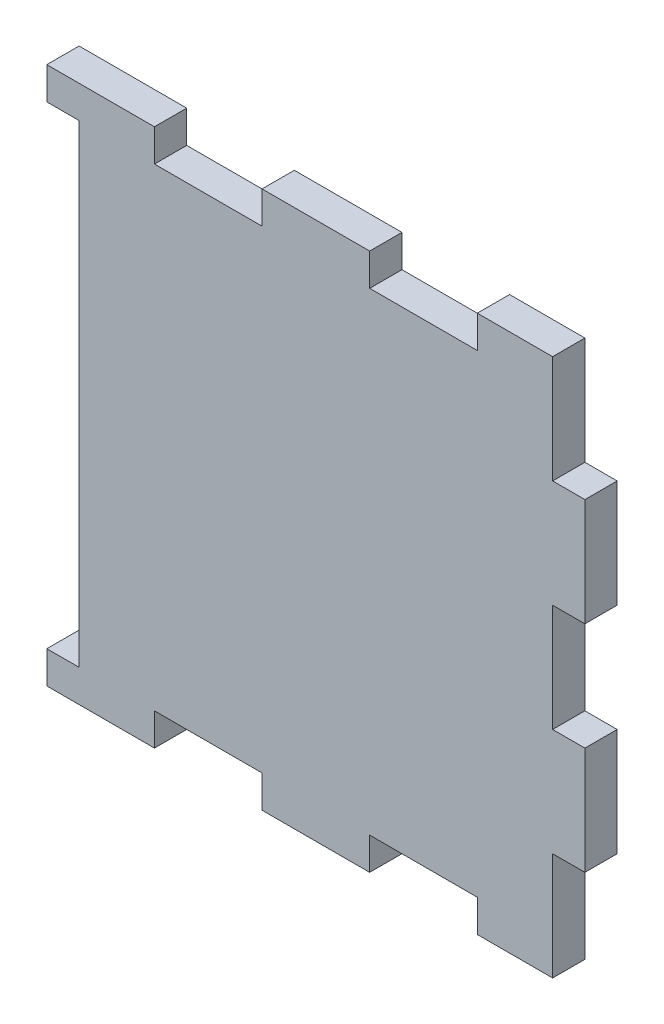
ISO-10303-21;
HEADER;
FILE_DESCRIPTION(('STEP AP214'),'2;1');
FILE_NAME('part.step','',(''),(''),'','','');
FILE_SCHEMA(('AUTOMOTIVE_DESIGN { 1 0 10303 214 1 1 1 1 }'));
ENDSEC;
DATA;
#1=APPLICATION_CONTEXT('core data for automotive mechanical design processes');
#2=APPLICATION_PROTOCOL_DEFINITION('international standard','automotive_design',2000,#1);
#3=PRODUCT_CONTEXT('',#1,'mechanical');
#4=PRODUCT('Part','Part','',(#3));
#5=PRODUCT_RELATED_PRODUCT_CATEGORY('part','',(#4));
#6=PRODUCT_DEFINITION_FORMATION('','',#4);
#7=PRODUCT_DEFINITION_CONTEXT('part definition',#1,'design');
#8=PRODUCT_DEFINITION('design','',#6,#7);
#9=PRODUCT_DEFINITION_SHAPE('','',#8);
#10=(LENGTH_UNIT() NAMED_UNIT(*) SI_UNIT(.MILLI.,.METRE.));
#11=(NAMED_UNIT(*) PLANE_ANGLE_UNIT() SI_UNIT($,.RADIAN.));
#12=(NAMED_UNIT(*) SI_UNIT($,.STERADIAN.) SOLID_ANGLE_UNIT());
#13=UNCERTAINTY_MEASURE_WITH_UNIT(LENGTH_MEASURE(1.E-05),#10,'distance_accuracy_value','');
#14=(GEOMETRIC_REPRESENTATION_CONTEXT(3) GLOBAL_UNCERTAINTY_ASSIGNED_CONTEXT((#13)) GLOBAL_UNIT_ASSIGNED_CONTEXT((#10,
#11,#12)) REPRESENTATION_CONTEXT('',''));
#15=CARTESIAN_POINT('',(0.,0.,0.));
#16=DIRECTION('',(0.,0.,1.));
#17=DIRECTION('',(1.,0.,0.));
#18=AXIS2_PLACEMENT_3D('',#15,#16,#17);
#19=CARTESIAN_POINT('',(-25.,-25.,3.));
#20=DIRECTION('',(1.,0.,0.));
#21=DIRECTION('',(0.,0.,-1.));
#22=AXIS2_PLACEMENT_3D('',#19,#20,#21);
#23=PLANE('',#22);
#24=DIRECTION('',(0.,-1.,0.));
#25=VECTOR('',#24,1.);
#26=CARTESIAN_POINT('',(-25.,-25.,3.));
#27=LINE('',#26,#25);
#28=CARTESIAN_POINT('',(-25.,-21.9999999999989,3.));
#29=VERTEX_POINT('',#28);
#30=CARTESIAN_POINT('',(-25.,-25.,3.));
#31=VERTEX_POINT('',#30);
#32=EDGE_CURVE('E457',#29,#31,#27,.T.);
#33=ORIENTED_EDGE('',*,*,#32,.F.);
#34=DIRECTION('',(0.,0.,-1.));
#35=VECTOR('',#34,1.);
#36=CARTESIAN_POINT('',(-25.,-21.9999999999989,14.9999999999996));
#37=LINE('',#36,#35);
#38=CARTESIAN_POINT('',(-25.,-21.9999999999989,-3.87710696880816E-13));
#39=VERTEX_POINT('',#38);
#40=EDGE_CURVE('E266',#29,#39,#37,.T.);
#41=ORIENTED_EDGE('',*,*,#40,.T.);
#42=DIRECTION('',(0.,-1.,0.));
#43=VECTOR('',#42,1.);
#44=CARTESIAN_POINT('',(-25.,-25.,0.));
#45=LINE('',#44,#43);
#46=CARTESIAN_POINT('',(-25.,-25.,0.));
#47=VERTEX_POINT('',#46);
#48=EDGE_CURVE('E271',#39,#47,#45,.T.);
#49=ORIENTED_EDGE('',*,*,#48,.T.);
#50=DIRECTION('',(0.,0.,-1.));
#51=VECTOR('',#50,1.);
#52=CARTESIAN_POINT('',(-25.,-25.,3.));
#53=LINE('',#52,#51);
#54=EDGE_CURVE('E461',#31,#47,#53,.T.);
#55=ORIENTED_EDGE('',*,*,#54,.F.);
#56=EDGE_LOOP('',(#33,#41,#49,#55));
#57=FACE_BOUND('',#56,.T.);
#58=ADVANCED_FACE('F43',(#57),#23,.F.);
#59=CARTESIAN_POINT('',(0.,0.,3.));
#60=DIRECTION('',(0.,0.,-1.));
#61=DIRECTION('',(-1.,0.,0.));
#62=AXIS2_PLACEMENT_3D('',#59,#60,#61);
#63=PLANE('',#62);
#64=DIRECTION('',(-1.,0.,0.));
#65=VECTOR('',#64,1.);
#66=CARTESIAN_POINT('',(0.,22.0000000000011,3.));
#67=LINE('',#66,#65);
#68=CARTESIAN_POINT('',(-22.,22.0000000000011,3.));
#69=VERTEX_POINT('',#68);
#70=CARTESIAN_POINT('',(-25.,22.0000000000011,3.));
#71=VERTEX_POINT('',#70);
#72=EDGE_CURVE('E11',#69,#71,#67,.T.);
#73=ORIENTED_EDGE('',*,*,#72,.F.);
#74=DIRECTION('',(0.,1.,0.));
#75=VECTOR('',#74,1.);
#76=CARTESIAN_POINT('',(-22.,0.,3.));
#77=LINE('',#76,#75);
#78=CARTESIAN_POINT('',(-22.,-21.9999999999989,3.));
#79=VERTEX_POINT('',#78);
#80=EDGE_CURVE('E273',#79,#69,#77,.T.);
#81=ORIENTED_EDGE('',*,*,#80,.F.);
#82=DIRECTION('',(1.,0.,0.));
#83=VECTOR('',#82,1.);
#84=CARTESIAN_POINT('',(0.,-21.9999999999989,3.));
#85=LINE('',#84,#83);
#86=EDGE_CURVE('E51',#29,#79,#85,.T.);
#87=ORIENTED_EDGE('',*,*,#86,.F.);
#88=ORIENTED_EDGE('',*,*,#32,.T.);
#89=DIRECTION('',(1.,0.,0.));
#90=VECTOR('',#89,1.);
#91=CARTESIAN_POINT('',(-25.,-25.,3.));
#92=LINE('',#91,#90);
#93=CARTESIAN_POINT('',(-15.,-25.,3.));
#94=VERTEX_POINT('',#93);
#95=EDGE_CURVE('E458',#31,#94,#92,.T.);
#96=ORIENTED_EDGE('',*,*,#95,.T.);
#97=DIRECTION('',(0.,-1.,0.));
#98=VECTOR('',#97,1.);
#99=CARTESIAN_POINT('',(-15.,-25.,3.));
#100=LINE('',#99,#98);
#101=CARTESIAN_POINT('',(-15.,-22.,3.));
#102=VERTEX_POINT('',#101);
#103=EDGE_CURVE('E335',#102,#94,#100,.T.);
#104=ORIENTED_EDGE('',*,*,#103,.F.);
#105=DIRECTION('',(-1.,0.,0.));
#106=VECTOR('',#105,1.);
#107=CARTESIAN_POINT('',(-15.,-22.,3.));
#108=LINE('',#107,#106);
#109=CARTESIAN_POINT('',(-5.,-22.,3.));
#110=VERTEX_POINT('',#109);
#111=EDGE_CURVE('E337',#110,#102,#108,.T.);
#112=ORIENTED_EDGE('',*,*,#111,.F.);
#113=DIRECTION('',(0.,1.,0.));
#114=VECTOR('',#113,1.);
#115=CARTESIAN_POINT('',(-5.00000000000001,-25.,3.));
#116=LINE('',#115,#114);
#117=CARTESIAN_POINT('',(-5.00000000000001,-25.,3.));
#118=VERTEX_POINT('',#117);
#119=EDGE_CURVE('E341',#118,#110,#116,.T.);
#120=ORIENTED_EDGE('',*,*,#119,.F.);
#121=CARTESIAN_POINT('',(5.,-25.,3.));
#122=VERTEX_POINT('',#121);
#123=EDGE_CURVE('E462',#118,#122,#92,.T.);
#124=ORIENTED_EDGE('',*,*,#123,.T.);
#125=DIRECTION('',(0.,-1.,0.));
#126=VECTOR('',#125,1.);
#127=CARTESIAN_POINT('',(5.,-25.,3.));
#128=LINE('',#127,#126);
#129=CARTESIAN_POINT('',(5.,-22.,3.));
#130=VERTEX_POINT('',#129);
#131=EDGE_CURVE('E403',#130,#122,#128,.T.);
#132=ORIENTED_EDGE('',*,*,#131,.F.);
#133=DIRECTION('',(-1.,0.,0.));
#134=VECTOR('',#133,1.);
#135=CARTESIAN_POINT('',(5.,-22.,3.));
#136=LINE('',#135,#134);
#137=CARTESIAN_POINT('',(15.,-22.,3.));
#138=VERTEX_POINT('',#137);
#139=EDGE_CURVE('E405',#138,#130,#136,.T.);
#140=ORIENTED_EDGE('',*,*,#139,.F.);
#141=DIRECTION('',(0.,1.,0.));
#142=VECTOR('',#141,1.);
#143=CARTESIAN_POINT('',(15.,-25.,3.));
#144=LINE('',#143,#142);
#145=CARTESIAN_POINT('',(15.,-25.,3.));
#146=VERTEX_POINT('',#145);
#147=EDGE_CURVE('E376',#146,#138,#144,.T.);
#148=ORIENTED_EDGE('',*,*,#147,.F.);
#149=CARTESIAN_POINT('',(22.,-25.,3.));
#150=VERTEX_POINT('',#149);
#151=EDGE_CURVE('E456',#146,#150,#92,.T.);
#152=ORIENTED_EDGE('',*,*,#151,.T.);
#153=DIRECTION('',(0.,-1.,0.));
#154=VECTOR('',#153,1.);
#155=CARTESIAN_POINT('',(22.,-25.,3.));
#156=LINE('',#155,#154);
#157=CARTESIAN_POINT('',(22.,-15.,3.));
#158=VERTEX_POINT('',#157);
#159=EDGE_CURVE('E289',#158,#150,#156,.T.);
#160=ORIENTED_EDGE('',*,*,#159,.F.);
#161=DIRECTION('',(-1.,0.,0.));
#162=VECTOR('',#161,1.);
#163=CARTESIAN_POINT('',(25.,-15.,3.));
#164=LINE('',#163,#162);
#165=CARTESIAN_POINT('',(25.,-15.,3.));
#166=VERTEX_POINT('',#165);
#167=EDGE_CURVE('E291',#166,#158,#164,.T.);
#168=ORIENTED_EDGE('',*,*,#167,.F.);
#169=DIRECTION('',(0.,1.,0.));
#170=VECTOR('',#169,1.);
#171=CARTESIAN_POINT('',(25.,-25.,3.));
#172=LINE('',#171,#170);
#173=CARTESIAN_POINT('',(25.,-5.,3.));
#174=VERTEX_POINT('',#173);
#175=EDGE_CURVE('E447',#166,#174,#172,.T.);
#176=ORIENTED_EDGE('',*,*,#175,.T.);
#177=DIRECTION('',(1.,0.,0.));
#178=VECTOR('',#177,1.);
#179=CARTESIAN_POINT('',(25.,-5.,3.));
#180=LINE('',#179,#178);
#181=CARTESIAN_POINT('',(22.,-5.,3.));
#182=VERTEX_POINT('',#181);
#183=EDGE_CURVE('E309',#182,#174,#180,.T.);
#184=ORIENTED_EDGE('',*,*,#183,.F.);
#185=DIRECTION('',(0.,-1.,0.));
#186=VECTOR('',#185,1.);
#187=CARTESIAN_POINT('',(22.,5.,3.));
#188=LINE('',#187,#186);
#189=CARTESIAN_POINT('',(22.,5.,3.));
#190=VERTEX_POINT('',#189);
#191=EDGE_CURVE('E311',#190,#182,#188,.T.);
#192=ORIENTED_EDGE('',*,*,#191,.F.);
#193=DIRECTION('',(-1.,0.,0.));
#194=VECTOR('',#193,1.);
#195=CARTESIAN_POINT('',(25.,5.,3.));
#196=LINE('',#195,#194);
#197=CARTESIAN_POINT('',(25.,5.,3.));
#198=VERTEX_POINT('',#197);
#199=EDGE_CURVE('E288',#198,#190,#196,.T.);
#200=ORIENTED_EDGE('',*,*,#199,.F.);
#201=CARTESIAN_POINT('',(25.,15.,3.));
#202=VERTEX_POINT('',#201);
#203=EDGE_CURVE('E444',#198,#202,#172,.T.);
#204=ORIENTED_EDGE('',*,*,#203,.T.);
#205=DIRECTION('',(1.,0.,0.));
#206=VECTOR('',#205,1.);
#207=CARTESIAN_POINT('',(25.,15.,3.));
#208=LINE('',#207,#206);
#209=CARTESIAN_POINT('',(22.,15.,3.));
#210=VERTEX_POINT('',#209);
#211=EDGE_CURVE('E358',#210,#202,#208,.T.);
#212=ORIENTED_EDGE('',*,*,#211,.F.);
#213=DIRECTION('',(0.,-1.,0.));
#214=VECTOR('',#213,1.);
#215=CARTESIAN_POINT('',(22.,25.,3.));
#216=LINE('',#215,#214);
#217=CARTESIAN_POINT('',(22.,25.,3.));
#218=VERTEX_POINT('',#217);
#219=EDGE_CURVE('E334',#218,#210,#216,.T.);
#220=ORIENTED_EDGE('',*,*,#219,.F.);
#221=DIRECTION('',(-1.,0.,0.));
#222=VECTOR('',#221,1.);
#223=CARTESIAN_POINT('',(-25.,25.,3.));
#224=LINE('',#223,#222);
#225=CARTESIAN_POINT('',(15.,25.,3.));
#226=VERTEX_POINT('',#225);
#227=EDGE_CURVE('E452',#218,#226,#224,.T.);
#228=ORIENTED_EDGE('',*,*,#227,.T.);
#229=DIRECTION('',(0.,1.,0.));
#230=VECTOR('',#229,1.);
#231=CARTESIAN_POINT('',(15.,25.,3.));
#232=LINE('',#231,#230);
#233=CARTESIAN_POINT('',(15.,22.,3.));
#234=VERTEX_POINT('',#233);
#235=EDGE_CURVE('E377',#234,#226,#232,.T.);
#236=ORIENTED_EDGE('',*,*,#235,.F.);
#237=DIRECTION('',(1.,0.,0.));
#238=VECTOR('',#237,1.);
#239=CARTESIAN_POINT('',(5.,22.,3.));
#240=LINE('',#239,#238);
#241=CARTESIAN_POINT('',(5.,22.,3.));
#242=VERTEX_POINT('',#241);
#243=EDGE_CURVE('E379',#242,#234,#240,.T.);
#244=ORIENTED_EDGE('',*,*,#243,.F.);
#245=DIRECTION('',(0.,-1.,0.));
#246=VECTOR('',#245,1.);
#247=CARTESIAN_POINT('',(5.,25.,3.));
#248=LINE('',#247,#246);
#249=CARTESIAN_POINT('',(5.,25.,3.));
#250=VERTEX_POINT('',#249);
#251=EDGE_CURVE('E383',#250,#242,#248,.T.);
#252=ORIENTED_EDGE('',*,*,#251,.F.);
#253=CARTESIAN_POINT('',(-5.00000000000001,25.,3.));
#254=VERTEX_POINT('',#253);
#255=EDGE_CURVE('E451',#250,#254,#224,.T.);
#256=ORIENTED_EDGE('',*,*,#255,.T.);
#257=DIRECTION('',(0.,1.,0.));
#258=VECTOR('',#257,1.);
#259=CARTESIAN_POINT('',(-5.00000000000001,25.,3.));
#260=LINE('',#259,#258);
#261=CARTESIAN_POINT('',(-5.,22.,3.));
#262=VERTEX_POINT('',#261);
#263=EDGE_CURVE('E422',#262,#254,#260,.T.);
#264=ORIENTED_EDGE('',*,*,#263,.F.);
#265=DIRECTION('',(1.,0.,0.));
#266=VECTOR('',#265,1.);
#267=CARTESIAN_POINT('',(-15.,22.,3.));
#268=LINE('',#267,#266);
#269=CARTESIAN_POINT('',(-15.,22.,3.));
#270=VERTEX_POINT('',#269);
#271=EDGE_CURVE('E431',#270,#262,#268,.T.);
#272=ORIENTED_EDGE('',*,*,#271,.F.);
#273=DIRECTION('',(0.,-1.,0.));
#274=VECTOR('',#273,1.);
#275=CARTESIAN_POINT('',(-15.,25.,3.));
#276=LINE('',#275,#274);
#277=CARTESIAN_POINT('',(-15.,25.,3.));
#278=VERTEX_POINT('',#277);
#279=EDGE_CURVE('E386',#278,#270,#276,.T.);
#280=ORIENTED_EDGE('',*,*,#279,.F.);
#281=CARTESIAN_POINT('',(-25.,25.,3.));
#282=VERTEX_POINT('',#281);
#283=EDGE_CURVE('E449',#278,#282,#224,.T.);
#284=ORIENTED_EDGE('',*,*,#283,.T.);
#285=EDGE_CURVE('E453',#282,#71,#27,.T.);
#286=ORIENTED_EDGE('',*,*,#285,.T.);
#287=EDGE_LOOP('',(#73,#81,#87,#88,#96,#104,#112,#120,#124,#132,#140,#148,#152,#160,#168,#176,
#184,#192,#200,#204,#212,#220,#228,#236,#244,#252,#256,#264,#272,#280,#284,#286));
#288=FACE_BOUND('',#287,.T.);
#289=ADVANCED_FACE('F498',(#288),#63,.F.);
#290=CARTESIAN_POINT('',(0.,0.,0.));
#291=DIRECTION('',(0.,0.,-1.));
#292=DIRECTION('',(-1.,0.,0.));
#293=AXIS2_PLACEMENT_3D('',#290,#291,#292);
#294=PLANE('',#293);
#295=DIRECTION('',(0.,1.,0.));
#296=VECTOR('',#295,1.);
#297=CARTESIAN_POINT('',(-22.,-21.9999999999989,-3.87710696880816E-13));
#298=LINE('',#297,#296);
#299=CARTESIAN_POINT('',(-22.,-21.9999999999989,-3.87710696880816E-13));
#300=VERTEX_POINT('',#299);
#301=CARTESIAN_POINT('',(-22.,22.0000000000011,0.));
#302=VERTEX_POINT('',#301);
#303=EDGE_CURVE('E263',#300,#302,#298,.T.);
#304=ORIENTED_EDGE('',*,*,#303,.T.);
#305=DIRECTION('',(-1.,0.,0.));
#306=VECTOR('',#305,1.);
#307=CARTESIAN_POINT('',(-22.,22.0000000000011,-3.87710696880816E-13));
#308=LINE('',#307,#306);
#309=CARTESIAN_POINT('',(-25.,22.0000000000011,-3.87710696880816E-13));
#310=VERTEX_POINT('',#309);
#311=EDGE_CURVE('E58',#302,#310,#308,.T.);
#312=ORIENTED_EDGE('',*,*,#311,.T.);
#313=CARTESIAN_POINT('',(-25.,25.,0.));
#314=VERTEX_POINT('',#313);
#315=EDGE_CURVE('E470',#314,#310,#45,.T.);
#316=ORIENTED_EDGE('',*,*,#315,.F.);
#317=DIRECTION('',(-1.,0.,0.));
#318=VECTOR('',#317,1.);
#319=CARTESIAN_POINT('',(-25.,25.,0.));
#320=LINE('',#319,#318);
#321=CARTESIAN_POINT('',(-15.,25.,0.));
#322=VERTEX_POINT('',#321);
#323=EDGE_CURVE('E466',#322,#314,#320,.T.);
#324=ORIENTED_EDGE('',*,*,#323,.F.);
#325=DIRECTION('',(0.,-1.,0.));
#326=VECTOR('',#325,1.);
#327=CARTESIAN_POINT('',(-15.,25.,0.));
#328=LINE('',#327,#326);
#329=CARTESIAN_POINT('',(-15.,22.,0.));
#330=VERTEX_POINT('',#329);
#331=EDGE_CURVE('E418',#322,#330,#328,.T.);
#332=ORIENTED_EDGE('',*,*,#331,.T.);
#333=DIRECTION('',(1.,0.,0.));
#334=VECTOR('',#333,1.);
#335=CARTESIAN_POINT('',(-15.,22.,0.));
#336=LINE('',#335,#334);
#337=CARTESIAN_POINT('',(-5.,22.,0.));
#338=VERTEX_POINT('',#337);
#339=EDGE_CURVE('E421',#330,#338,#336,.T.);
#340=ORIENTED_EDGE('',*,*,#339,.T.);
#341=DIRECTION('',(0.,1.,0.));
#342=VECTOR('',#341,1.);
#343=CARTESIAN_POINT('',(-5.00000000000001,25.,0.));
#344=LINE('',#343,#342);
#345=CARTESIAN_POINT('',(-5.00000000000001,25.,0.));
#346=VERTEX_POINT('',#345);
#347=EDGE_CURVE('E425',#338,#346,#344,.T.);
#348=ORIENTED_EDGE('',*,*,#347,.T.);
#349=CARTESIAN_POINT('',(5.,25.,0.));
#350=VERTEX_POINT('',#349);
#351=EDGE_CURVE('E468',#350,#346,#320,.T.);
#352=ORIENTED_EDGE('',*,*,#351,.F.);
#353=DIRECTION('',(0.,-1.,0.));
#354=VECTOR('',#353,1.);
#355=CARTESIAN_POINT('',(5.,25.,0.));
#356=LINE('',#355,#354);
#357=CARTESIAN_POINT('',(5.,22.,0.));
#358=VERTEX_POINT('',#357);
#359=EDGE_CURVE('E380',#350,#358,#356,.T.);
#360=ORIENTED_EDGE('',*,*,#359,.T.);
#361=DIRECTION('',(1.,0.,0.));
#362=VECTOR('',#361,1.);
#363=CARTESIAN_POINT('',(5.,22.,0.));
#364=LINE('',#363,#362);
#365=CARTESIAN_POINT('',(15.,22.,0.));
#366=VERTEX_POINT('',#365);
#367=EDGE_CURVE('E389',#358,#366,#364,.T.);
#368=ORIENTED_EDGE('',*,*,#367,.T.);
#369=DIRECTION('',(0.,1.,0.));
#370=VECTOR('',#369,1.);
#371=CARTESIAN_POINT('',(15.,25.,0.));
#372=LINE('',#371,#370);
#373=CARTESIAN_POINT('',(15.,25.,0.));
#374=VERTEX_POINT('',#373);
#375=EDGE_CURVE('E368',#366,#374,#372,.T.);
#376=ORIENTED_EDGE('',*,*,#375,.T.);
#377=CARTESIAN_POINT('',(22.,25.,0.));
#378=VERTEX_POINT('',#377);
#379=EDGE_CURVE('E469',#378,#374,#320,.T.);
#380=ORIENTED_EDGE('',*,*,#379,.F.);
#381=DIRECTION('',(0.,-1.,0.));
#382=VECTOR('',#381,1.);
#383=CARTESIAN_POINT('',(22.,25.,0.));
#384=LINE('',#383,#382);
#385=CARTESIAN_POINT('',(22.,15.,0.));
#386=VERTEX_POINT('',#385);
#387=EDGE_CURVE('E360',#378,#386,#384,.T.);
#388=ORIENTED_EDGE('',*,*,#387,.T.);
#389=DIRECTION('',(1.,0.,0.));
#390=VECTOR('',#389,1.);
#391=CARTESIAN_POINT('',(25.,15.,0.));
#392=LINE('',#391,#390);
#393=CARTESIAN_POINT('',(25.,15.,0.));
#394=VERTEX_POINT('',#393);
#395=EDGE_CURVE('E66',#386,#394,#392,.T.);
#396=ORIENTED_EDGE('',*,*,#395,.T.);
#397=DIRECTION('',(0.,1.,0.));
#398=VECTOR('',#397,1.);
#399=CARTESIAN_POINT('',(25.,-25.,0.));
#400=LINE('',#399,#398);
#401=CARTESIAN_POINT('',(25.,5.,0.));
#402=VERTEX_POINT('',#401);
#403=EDGE_CURVE('E437',#402,#394,#400,.T.);
#404=ORIENTED_EDGE('',*,*,#403,.F.);
#405=DIRECTION('',(-1.,0.,0.));
#406=VECTOR('',#405,1.);
#407=CARTESIAN_POINT('',(25.,5.,0.));
#408=LINE('',#407,#406);
#409=CARTESIAN_POINT('',(22.,5.,0.));
#410=VERTEX_POINT('',#409);
#411=EDGE_CURVE('E312',#402,#410,#408,.T.);
#412=ORIENTED_EDGE('',*,*,#411,.T.);
#413=DIRECTION('',(0.,-1.,0.));
#414=VECTOR('',#413,1.);
#415=CARTESIAN_POINT('',(22.,5.,0.));
#416=LINE('',#415,#414);
#417=CARTESIAN_POINT('',(22.,-5.,0.));
#418=VERTEX_POINT('',#417);
#419=EDGE_CURVE('E319',#410,#418,#416,.T.);
#420=ORIENTED_EDGE('',*,*,#419,.T.);
#421=DIRECTION('',(1.,0.,0.));
#422=VECTOR('',#421,1.);
#423=CARTESIAN_POINT('',(25.,-5.,0.));
#424=LINE('',#423,#422);
#425=CARTESIAN_POINT('',(25.,-5.,0.));
#426=VERTEX_POINT('',#425);
#427=EDGE_CURVE('E302',#418,#426,#424,.T.);
#428=ORIENTED_EDGE('',*,*,#427,.T.);
#429=CARTESIAN_POINT('',(25.,-15.,0.));
#430=VERTEX_POINT('',#429);
#431=EDGE_CURVE('E465',#430,#426,#400,.T.);
#432=ORIENTED_EDGE('',*,*,#431,.F.);
#433=DIRECTION('',(-1.,0.,0.));
#434=VECTOR('',#433,1.);
#435=CARTESIAN_POINT('',(25.,-15.,0.));
#436=LINE('',#435,#434);
#437=CARTESIAN_POINT('',(22.,-15.,0.));
#438=VERTEX_POINT('',#437);
#439=EDGE_CURVE('E292',#430,#438,#436,.T.);
#440=ORIENTED_EDGE('',*,*,#439,.T.);
#441=DIRECTION('',(0.,-1.,0.));
#442=VECTOR('',#441,1.);
#443=CARTESIAN_POINT('',(22.,-25.,0.));
#444=LINE('',#443,#442);
#445=CARTESIAN_POINT('',(22.,-25.,0.));
#446=VERTEX_POINT('',#445);
#447=EDGE_CURVE('E282',#438,#446,#444,.T.);
#448=ORIENTED_EDGE('',*,*,#447,.T.);
#449=DIRECTION('',(1.,0.,0.));
#450=VECTOR('',#449,1.);
#451=CARTESIAN_POINT('',(-25.,-25.,0.));
#452=LINE('',#451,#450);
#453=CARTESIAN_POINT('',(15.,-25.,0.));
#454=VERTEX_POINT('',#453);
#455=EDGE_CURVE('E473',#454,#446,#452,.T.);
#456=ORIENTED_EDGE('',*,*,#455,.F.);
#457=DIRECTION('',(0.,1.,0.));
#458=VECTOR('',#457,1.);
#459=CARTESIAN_POINT('',(15.,-25.,0.));
#460=LINE('',#459,#458);
#461=CARTESIAN_POINT('',(15.,-22.,0.));
#462=VERTEX_POINT('',#461);
#463=EDGE_CURVE('E406',#454,#462,#460,.T.);
#464=ORIENTED_EDGE('',*,*,#463,.T.);
#465=DIRECTION('',(-1.,0.,0.));
#466=VECTOR('',#465,1.);
#467=CARTESIAN_POINT('',(5.,-22.,0.));
#468=LINE('',#467,#466);
#469=CARTESIAN_POINT('',(5.,-22.,0.));
#470=VERTEX_POINT('',#469);
#471=EDGE_CURVE('E413',#462,#470,#468,.T.);
#472=ORIENTED_EDGE('',*,*,#471,.T.);
#473=DIRECTION('',(0.,-1.,0.));
#474=VECTOR('',#473,1.);
#475=CARTESIAN_POINT('',(5.,-25.,0.));
#476=LINE('',#475,#474);
#477=CARTESIAN_POINT('',(5.,-25.,0.));
#478=VERTEX_POINT('',#477);
#479=EDGE_CURVE('E396',#470,#478,#476,.T.);
#480=ORIENTED_EDGE('',*,*,#479,.T.);
#481=CARTESIAN_POINT('',(-5.00000000000001,-25.,0.));
#482=VERTEX_POINT('',#481);
#483=EDGE_CURVE('E476',#482,#478,#452,.T.);
#484=ORIENTED_EDGE('',*,*,#483,.F.);
#485=DIRECTION('',(0.,1.,0.));
#486=VECTOR('',#485,1.);
#487=CARTESIAN_POINT('',(-5.00000000000001,-25.,0.));
#488=LINE('',#487,#486);
#489=CARTESIAN_POINT('',(-5.,-22.,0.));
#490=VERTEX_POINT('',#489);
#491=EDGE_CURVE('E338',#482,#490,#488,.T.);
#492=ORIENTED_EDGE('',*,*,#491,.T.);
#493=DIRECTION('',(-1.,0.,0.));
#494=VECTOR('',#493,1.);
#495=CARTESIAN_POINT('',(-15.,-22.,0.));
#496=LINE('',#495,#494);
#497=CARTESIAN_POINT('',(-15.,-22.,0.));
#498=VERTEX_POINT('',#497);
#499=EDGE_CURVE('E347',#490,#498,#496,.T.);
#500=ORIENTED_EDGE('',*,*,#499,.T.);
#501=DIRECTION('',(0.,-1.,0.));
#502=VECTOR('',#501,1.);
#503=CARTESIAN_POINT('',(-15.,-25.,0.));
#504=LINE('',#503,#502);
#505=CARTESIAN_POINT('',(-15.,-25.,0.));
#506=VERTEX_POINT('',#505);
#507=EDGE_CURVE('E326',#498,#506,#504,.T.);
#508=ORIENTED_EDGE('',*,*,#507,.T.);
#509=EDGE_CURVE('E448',#47,#506,#452,.T.);
#510=ORIENTED_EDGE('',*,*,#509,.F.);
#511=ORIENTED_EDGE('',*,*,#48,.F.);
#512=DIRECTION('',(-1.,0.,0.));
#513=VECTOR('',#512,1.);
#514=CARTESIAN_POINT('',(-22.,-21.9999999999989,-3.87710696880816E-13));
#515=LINE('',#514,#513);
#516=EDGE_CURVE('E255',#300,#39,#515,.T.);
#517=ORIENTED_EDGE('',*,*,#516,.F.);
#518=EDGE_LOOP('',(#304,#312,#316,#324,#332,#340,#348,#352,#360,#368,#376,#380,#388,#396,#404,
#412,#420,#428,#432,#440,#448,#456,#464,#472,#480,#484,#492,#500,#508,#510,#511,#517));
#519=FACE_BOUND('',#518,.T.);
#520=ADVANCED_FACE('F269',(#519),#294,.T.);
#521=CARTESIAN_POINT('',(25.,-25.,3.));
#522=DIRECTION('',(-1.,0.,0.));
#523=DIRECTION('',(0.,0.,1.));
#524=AXIS2_PLACEMENT_3D('',#521,#522,#523);
#525=PLANE('',#524);
#526=ORIENTED_EDGE('',*,*,#175,.F.);
#527=DIRECTION('',(0.,0.,1.));
#528=VECTOR('',#527,1.);
#529=CARTESIAN_POINT('',(25.,-15.,0.));
#530=LINE('',#529,#528);
#531=EDGE_CURVE('E280',#430,#166,#530,.T.);
#532=ORIENTED_EDGE('',*,*,#531,.F.);
#533=ORIENTED_EDGE('',*,*,#431,.T.);
#534=DIRECTION('',(0.,0.,1.));
#535=VECTOR('',#534,1.);
#536=CARTESIAN_POINT('',(25.,-5.,0.));
#537=LINE('',#536,#535);
#538=EDGE_CURVE('E279',#426,#174,#537,.T.);
#539=ORIENTED_EDGE('',*,*,#538,.T.);
#540=EDGE_LOOP('',(#526,#532,#533,#539));
#541=FACE_BOUND('',#540,.T.);
#542=ADVANCED_FACE('F566',(#541),#525,.F.);
#543=CARTESIAN_POINT('',(-25.,25.,3.));
#544=DIRECTION('',(0.,-1.,0.));
#545=DIRECTION('',(0.,0.,-1.));
#546=AXIS2_PLACEMENT_3D('',#543,#544,#545);
#547=PLANE('',#546);
#548=ORIENTED_EDGE('',*,*,#255,.F.);
#549=DIRECTION('',(0.,0.,1.));
#550=VECTOR('',#549,1.);
#551=CARTESIAN_POINT('',(5.,25.,0.));
#552=LINE('',#551,#550);
#553=EDGE_CURVE('E374',#350,#250,#552,.T.);
#554=ORIENTED_EDGE('',*,*,#553,.F.);
#555=ORIENTED_EDGE('',*,*,#351,.T.);
#556=DIRECTION('',(0.,0.,1.));
#557=VECTOR('',#556,1.);
#558=CARTESIAN_POINT('',(-5.00000000000001,25.,0.));
#559=LINE('',#558,#557);
#560=EDGE_CURVE('E438',#346,#254,#559,.T.);
#561=ORIENTED_EDGE('',*,*,#560,.T.);
#562=EDGE_LOOP('',(#548,#554,#555,#561));
#563=FACE_BOUND('',#562,.T.);
#564=ADVANCED_FACE('F511',(#563),#547,.F.);
#565=ORIENTED_EDGE('',*,*,#283,.F.);
#566=DIRECTION('',(0.,0.,1.));
#567=VECTOR('',#566,1.);
#568=CARTESIAN_POINT('',(-15.,25.,0.));
#569=LINE('',#568,#567);
#570=EDGE_CURVE('E435',#322,#278,#569,.T.);
#571=ORIENTED_EDGE('',*,*,#570,.F.);
#572=ORIENTED_EDGE('',*,*,#323,.T.);
#573=DIRECTION('',(0.,0.,-1.));
#574=VECTOR('',#573,1.);
#575=CARTESIAN_POINT('',(-25.,25.,3.));
#576=LINE('',#575,#574);
#577=EDGE_CURVE('E479',#282,#314,#576,.T.);
#578=ORIENTED_EDGE('',*,*,#577,.F.);
#579=EDGE_LOOP('',(#565,#571,#572,#578));
#580=FACE_BOUND('',#579,.T.);
#581=ADVANCED_FACE('F491',(#580),#547,.F.);
#582=CARTESIAN_POINT('',(-25.,-25.,3.));
#583=DIRECTION('',(0.,1.,0.));
#584=DIRECTION('',(0.,0.,1.));
#585=AXIS2_PLACEMENT_3D('',#582,#583,#584);
#586=PLANE('',#585);
#587=ORIENTED_EDGE('',*,*,#509,.T.);
#588=DIRECTION('',(0.,0.,1.));
#589=VECTOR('',#588,1.);
#590=CARTESIAN_POINT('',(-15.,-25.,0.));
#591=LINE('',#590,#589);
#592=EDGE_CURVE('E331',#506,#94,#591,.T.);
#593=ORIENTED_EDGE('',*,*,#592,.T.);
#594=ORIENTED_EDGE('',*,*,#95,.F.);
#595=ORIENTED_EDGE('',*,*,#54,.T.);
#596=EDGE_LOOP('',(#587,#593,#594,#595));
#597=FACE_BOUND('',#596,.T.);
#598=ADVANCED_FACE('F521',(#597),#586,.F.);
#599=ORIENTED_EDGE('',*,*,#123,.F.);
#600=DIRECTION('',(0.,0.,1.));
#601=VECTOR('',#600,1.);
#602=CARTESIAN_POINT('',(-5.00000000000001,-25.,0.));
#603=LINE('',#602,#601);
#604=EDGE_CURVE('E324',#482,#118,#603,.T.);
#605=ORIENTED_EDGE('',*,*,#604,.F.);
#606=ORIENTED_EDGE('',*,*,#483,.T.);
#607=DIRECTION('',(0.,0.,1.));
#608=VECTOR('',#607,1.);
#609=CARTESIAN_POINT('',(5.,-25.,0.));
#610=LINE('',#609,#608);
#611=EDGE_CURVE('E344',#478,#122,#610,.T.);
#612=ORIENTED_EDGE('',*,*,#611,.T.);
#613=EDGE_LOOP('',(#599,#605,#606,#612));
#614=FACE_BOUND('',#613,.T.);
#615=ADVANCED_FACE('F586',(#614),#586,.F.);
#616=ORIENTED_EDGE('',*,*,#403,.T.);
#617=DIRECTION('',(0.,0.,1.));
#618=VECTOR('',#617,1.);
#619=CARTESIAN_POINT('',(25.,15.,0.));
#620=LINE('',#619,#618);
#621=EDGE_CURVE('E295',#394,#202,#620,.T.);
#622=ORIENTED_EDGE('',*,*,#621,.T.);
#623=ORIENTED_EDGE('',*,*,#203,.F.);
#624=DIRECTION('',(0.,0.,1.));
#625=VECTOR('',#624,1.);
#626=CARTESIAN_POINT('',(25.,5.,0.));
#627=LINE('',#626,#625);
#628=EDGE_CURVE('E300',#402,#198,#627,.T.);
#629=ORIENTED_EDGE('',*,*,#628,.F.);
#630=EDGE_LOOP('',(#616,#622,#623,#629));
#631=FACE_BOUND('',#630,.T.);
#632=ADVANCED_FACE('F45',(#631),#525,.F.);
#633=ORIENTED_EDGE('',*,*,#227,.F.);
#634=DIRECTION('',(0.,0.,1.));
#635=VECTOR('',#634,1.);
#636=CARTESIAN_POINT('',(22.,25.,0.));
#637=LINE('',#636,#635);
#638=EDGE_CURVE('E352',#378,#218,#637,.T.);
#639=ORIENTED_EDGE('',*,*,#638,.F.);
#640=ORIENTED_EDGE('',*,*,#379,.T.);
#641=DIRECTION('',(0.,0.,1.));
#642=VECTOR('',#641,1.);
#643=CARTESIAN_POINT('',(15.,25.,0.));
#644=LINE('',#643,#642);
#645=EDGE_CURVE('E371',#374,#226,#644,.T.);
#646=ORIENTED_EDGE('',*,*,#645,.T.);
#647=EDGE_LOOP('',(#633,#639,#640,#646));
#648=FACE_BOUND('',#647,.T.);
#649=ADVANCED_FACE('F541',(#648),#547,.F.);
#650=ORIENTED_EDGE('',*,*,#315,.T.);
#651=DIRECTION('',(0.,0.,1.));
#652=VECTOR('',#651,1.);
#653=CARTESIAN_POINT('',(-25.,22.0000000000011,14.9999999999996));
#654=LINE('',#653,#652);
#655=EDGE_CURVE('E939',#310,#71,#654,.T.);
#656=ORIENTED_EDGE('',*,*,#655,.T.);
#657=ORIENTED_EDGE('',*,*,#285,.F.);
#658=ORIENTED_EDGE('',*,*,#577,.T.);
#659=EDGE_LOOP('',(#650,#656,#657,#658));
#660=FACE_BOUND('',#659,.T.);
#661=ADVANCED_FACE('F485',(#660),#23,.F.);
#662=ORIENTED_EDGE('',*,*,#151,.F.);
#663=DIRECTION('',(0.,0.,1.));
#664=VECTOR('',#663,1.);
#665=CARTESIAN_POINT('',(15.,-25.,0.));
#666=LINE('',#665,#664);
#667=EDGE_CURVE('E394',#454,#146,#666,.T.);
#668=ORIENTED_EDGE('',*,*,#667,.F.);
#669=ORIENTED_EDGE('',*,*,#455,.T.);
#670=DIRECTION('',(0.,0.,1.));
#671=VECTOR('',#670,1.);
#672=CARTESIAN_POINT('',(22.,-25.,0.));
#673=LINE('',#672,#671);
#674=EDGE_CURVE('E285',#446,#150,#673,.T.);
#675=ORIENTED_EDGE('',*,*,#674,.T.);
#676=EDGE_LOOP('',(#662,#668,#669,#675));
#677=FACE_BOUND('',#676,.T.);
#678=ADVANCED_FACE('F580',(#677),#586,.F.);
#679=CARTESIAN_POINT('',(-15.,25.,0.));
#680=DIRECTION('',(-1.,0.,0.));
#681=DIRECTION('',(0.,0.,1.));
#682=AXIS2_PLACEMENT_3D('',#679,#680,#681);
#683=PLANE('',#682);
#684=ORIENTED_EDGE('',*,*,#279,.T.);
#685=DIRECTION('',(0.,0.,1.));
#686=VECTOR('',#685,1.);
#687=CARTESIAN_POINT('',(-15.,22.,0.));
#688=LINE('',#687,#686);
#689=EDGE_CURVE('E428',#330,#270,#688,.T.);
#690=ORIENTED_EDGE('',*,*,#689,.F.);
#691=ORIENTED_EDGE('',*,*,#331,.F.);
#692=ORIENTED_EDGE('',*,*,#570,.T.);
#693=EDGE_LOOP('',(#684,#690,#691,#692));
#694=FACE_BOUND('',#693,.T.);
#695=ADVANCED_FACE('F494',(#694),#683,.F.);
#696=CARTESIAN_POINT('',(-5.00000000000001,25.,0.));
#697=DIRECTION('',(1.,0.,0.));
#698=DIRECTION('',(0.,1.,0.));
#699=AXIS2_PLACEMENT_3D('',#696,#697,#698);
#700=PLANE('',#699);
#701=ORIENTED_EDGE('',*,*,#263,.T.);
#702=ORIENTED_EDGE('',*,*,#560,.F.);
#703=ORIENTED_EDGE('',*,*,#347,.F.);
#704=DIRECTION('',(0.,0.,1.));
#705=VECTOR('',#704,1.);
#706=CARTESIAN_POINT('',(-5.,22.,0.));
#707=LINE('',#706,#705);
#708=EDGE_CURVE('E441',#338,#262,#707,.T.);
#709=ORIENTED_EDGE('',*,*,#708,.T.);
#710=EDGE_LOOP('',(#701,#702,#703,#709));
#711=FACE_BOUND('',#710,.T.);
#712=ADVANCED_FACE('F638',(#711),#700,.F.);
#713=CARTESIAN_POINT('',(-15.,22.,0.));
#714=DIRECTION('',(0.,-1.,0.));
#715=DIRECTION('',(0.,0.,-1.));
#716=AXIS2_PLACEMENT_3D('',#713,#714,#715);
#717=PLANE('',#716);
#718=ORIENTED_EDGE('',*,*,#271,.T.);
#719=ORIENTED_EDGE('',*,*,#708,.F.);
#720=ORIENTED_EDGE('',*,*,#339,.F.);
#721=ORIENTED_EDGE('',*,*,#689,.T.);
#722=EDGE_LOOP('',(#718,#719,#720,#721));
#723=FACE_BOUND('',#722,.T.);
#724=ADVANCED_FACE('F503',(#723),#717,.F.);
#725=CARTESIAN_POINT('',(25.,-5.,0.));
#726=DIRECTION('',(0.,-1.,0.));
#727=DIRECTION('',(0.,0.,-1.));
#728=AXIS2_PLACEMENT_3D('',#725,#726,#727);
#729=PLANE('',#728);
#730=ORIENTED_EDGE('',*,*,#183,.T.);
#731=ORIENTED_EDGE('',*,*,#538,.F.);
#732=ORIENTED_EDGE('',*,*,#427,.F.);
#733=DIRECTION('',(0.,0.,1.));
#734=VECTOR('',#733,1.);
#735=CARTESIAN_POINT('',(22.,-5.,0.));
#736=LINE('',#735,#734);
#737=EDGE_CURVE('E305',#418,#182,#736,.T.);
#738=ORIENTED_EDGE('',*,*,#737,.T.);
#739=EDGE_LOOP('',(#730,#731,#732,#738));
#740=FACE_BOUND('',#739,.T.);
#741=ADVANCED_FACE('F562',(#740),#729,.F.);
#742=CARTESIAN_POINT('',(22.,5.,0.));
#743=DIRECTION('',(-1.,0.,0.));
#744=DIRECTION('',(0.,0.,1.));
#745=AXIS2_PLACEMENT_3D('',#742,#743,#744);
#746=PLANE('',#745);
#747=ORIENTED_EDGE('',*,*,#191,.T.);
#748=ORIENTED_EDGE('',*,*,#737,.F.);
#749=ORIENTED_EDGE('',*,*,#419,.F.);
#750=DIRECTION('',(0.,0.,1.));
#751=VECTOR('',#750,1.);
#752=CARTESIAN_POINT('',(22.,5.,0.));
#753=LINE('',#752,#751);
#754=EDGE_CURVE('E303',#410,#190,#753,.T.);
#755=ORIENTED_EDGE('',*,*,#754,.T.);
#756=EDGE_LOOP('',(#747,#748,#749,#755));
#757=FACE_BOUND('',#756,.T.);
#758=ADVANCED_FACE('F560',(#757),#746,.F.);
#759=CARTESIAN_POINT('',(25.,5.,0.));
#760=DIRECTION('',(0.,1.,0.));
#761=DIRECTION('',(0.,0.,1.));
#762=AXIS2_PLACEMENT_3D('',#759,#760,#761);
#763=PLANE('',#762);
#764=ORIENTED_EDGE('',*,*,#199,.T.);
#765=ORIENTED_EDGE('',*,*,#754,.F.);
#766=ORIENTED_EDGE('',*,*,#411,.F.);
#767=ORIENTED_EDGE('',*,*,#628,.T.);
#768=EDGE_LOOP('',(#764,#765,#766,#767));
#769=FACE_BOUND('',#768,.T.);
#770=ADVANCED_FACE('F555',(#769),#763,.F.);
#771=CARTESIAN_POINT('',(22.,-25.,0.));
#772=DIRECTION('',(-1.,0.,0.));
#773=DIRECTION('',(0.,0.,1.));
#774=AXIS2_PLACEMENT_3D('',#771,#772,#773);
#775=PLANE('',#774);
#776=ORIENTED_EDGE('',*,*,#159,.T.);
#777=ORIENTED_EDGE('',*,*,#674,.F.);
#778=ORIENTED_EDGE('',*,*,#447,.F.);
#779=DIRECTION('',(0.,0.,1.));
#780=VECTOR('',#779,1.);
#781=CARTESIAN_POINT('',(22.,-15.,0.));
#782=LINE('',#781,#780);
#783=EDGE_CURVE('E283',#438,#158,#782,.T.);
#784=ORIENTED_EDGE('',*,*,#783,.T.);
#785=EDGE_LOOP('',(#776,#777,#778,#784));
#786=FACE_BOUND('',#785,.T.);
#787=ADVANCED_FACE('F669',(#786),#775,.F.);
#788=CARTESIAN_POINT('',(25.,-15.,0.));
#789=DIRECTION('',(0.,1.,0.));
#790=DIRECTION('',(0.,0.,1.));
#791=AXIS2_PLACEMENT_3D('',#788,#789,#790);
#792=PLANE('',#791);
#793=ORIENTED_EDGE('',*,*,#167,.T.);
#794=ORIENTED_EDGE('',*,*,#783,.F.);
#795=ORIENTED_EDGE('',*,*,#439,.F.);
#796=ORIENTED_EDGE('',*,*,#531,.T.);
#797=EDGE_LOOP('',(#793,#794,#795,#796));
#798=FACE_BOUND('',#797,.T.);
#799=ADVANCED_FACE('F573',(#798),#792,.F.);
#800=CARTESIAN_POINT('',(5.,25.,0.));
#801=DIRECTION('',(-1.,0.,0.));
#802=DIRECTION('',(0.,0.,1.));
#803=AXIS2_PLACEMENT_3D('',#800,#801,#802);
#804=PLANE('',#803);
#805=ORIENTED_EDGE('',*,*,#251,.T.);
#806=DIRECTION('',(0.,0.,1.));
#807=VECTOR('',#806,1.);
#808=CARTESIAN_POINT('',(5.,22.,0.));
#809=LINE('',#808,#807);
#810=EDGE_CURVE('E366',#358,#242,#809,.T.);
#811=ORIENTED_EDGE('',*,*,#810,.F.);
#812=ORIENTED_EDGE('',*,*,#359,.F.);
#813=ORIENTED_EDGE('',*,*,#553,.T.);
#814=EDGE_LOOP('',(#805,#811,#812,#813));
#815=FACE_BOUND('',#814,.T.);
#816=ADVANCED_FACE('F534',(#815),#804,.F.);
#817=CARTESIAN_POINT('',(15.,25.,0.));
#818=DIRECTION('',(1.,0.,0.));
#819=DIRECTION('',(0.,1.,0.));
#820=AXIS2_PLACEMENT_3D('',#817,#818,#819);
#821=PLANE('',#820);
#822=ORIENTED_EDGE('',*,*,#235,.T.);
#823=ORIENTED_EDGE('',*,*,#645,.F.);
#824=ORIENTED_EDGE('',*,*,#375,.F.);
#825=DIRECTION('',(0.,0.,1.));
#826=VECTOR('',#825,1.);
#827=CARTESIAN_POINT('',(15.,22.,0.));
#828=LINE('',#827,#826);
#829=EDGE_CURVE('E369',#366,#234,#828,.T.);
#830=ORIENTED_EDGE('',*,*,#829,.T.);
#831=EDGE_LOOP('',(#822,#823,#824,#830));
#832=FACE_BOUND('',#831,.T.);
#833=ADVANCED_FACE('F540',(#832),#821,.F.);
#834=CARTESIAN_POINT('',(5.,22.,0.));
#835=DIRECTION('',(0.,-1.,0.));
#836=DIRECTION('',(0.,0.,-1.));
#837=AXIS2_PLACEMENT_3D('',#834,#835,#836);
#838=PLANE('',#837);
#839=ORIENTED_EDGE('',*,*,#243,.T.);
#840=ORIENTED_EDGE('',*,*,#829,.F.);
#841=ORIENTED_EDGE('',*,*,#367,.F.);
#842=ORIENTED_EDGE('',*,*,#810,.T.);
#843=EDGE_LOOP('',(#839,#840,#841,#842));
#844=FACE_BOUND('',#843,.T.);
#845=ADVANCED_FACE('F538',(#844),#838,.F.);
#846=CARTESIAN_POINT('',(5.,-25.,0.));
#847=DIRECTION('',(-1.,0.,0.));
#848=DIRECTION('',(0.,0.,1.));
#849=AXIS2_PLACEMENT_3D('',#846,#847,#848);
#850=PLANE('',#849);
#851=ORIENTED_EDGE('',*,*,#131,.T.);
#852=ORIENTED_EDGE('',*,*,#611,.F.);
#853=ORIENTED_EDGE('',*,*,#479,.F.);
#854=DIRECTION('',(0.,0.,1.));
#855=VECTOR('',#854,1.);
#856=CARTESIAN_POINT('',(5.,-22.,0.));
#857=LINE('',#856,#855);
#858=EDGE_CURVE('E399',#470,#130,#857,.T.);
#859=ORIENTED_EDGE('',*,*,#858,.T.);
#860=EDGE_LOOP('',(#851,#852,#853,#859));
#861=FACE_BOUND('',#860,.T.);
#862=ADVANCED_FACE('F590',(#861),#850,.F.);
#863=CARTESIAN_POINT('',(5.,-22.,0.));
#864=DIRECTION('',(0.,1.,0.));
#865=DIRECTION('',(0.,0.,1.));
#866=AXIS2_PLACEMENT_3D('',#863,#864,#865);
#867=PLANE('',#866);
#868=ORIENTED_EDGE('',*,*,#139,.T.);
#869=ORIENTED_EDGE('',*,*,#858,.F.);
#870=ORIENTED_EDGE('',*,*,#471,.F.);
#871=DIRECTION('',(0.,0.,1.));
#872=VECTOR('',#871,1.);
#873=CARTESIAN_POINT('',(15.,-22.,0.));
#874=LINE('',#873,#872);
#875=EDGE_CURVE('E397',#462,#138,#874,.T.);
#876=ORIENTED_EDGE('',*,*,#875,.T.);
#877=EDGE_LOOP('',(#868,#869,#870,#876));
#878=FACE_BOUND('',#877,.T.);
#879=ADVANCED_FACE('F599',(#878),#867,.F.);
#880=CARTESIAN_POINT('',(15.,-25.,0.));
#881=DIRECTION('',(1.,0.,0.));
#882=DIRECTION('',(0.,1.,0.));
#883=AXIS2_PLACEMENT_3D('',#880,#881,#882);
#884=PLANE('',#883);
#885=ORIENTED_EDGE('',*,*,#147,.T.);
#886=ORIENTED_EDGE('',*,*,#875,.F.);
#887=ORIENTED_EDGE('',*,*,#463,.F.);
#888=ORIENTED_EDGE('',*,*,#667,.T.);
#889=EDGE_LOOP('',(#885,#886,#887,#888));
#890=FACE_BOUND('',#889,.T.);
#891=ADVANCED_FACE('F597',(#890),#884,.F.);
#892=CARTESIAN_POINT('',(-15.,-25.,0.));
#893=DIRECTION('',(-1.,0.,0.));
#894=DIRECTION('',(0.,0.,1.));
#895=AXIS2_PLACEMENT_3D('',#892,#893,#894);
#896=PLANE('',#895);
#897=ORIENTED_EDGE('',*,*,#103,.T.);
#898=ORIENTED_EDGE('',*,*,#592,.F.);
#899=ORIENTED_EDGE('',*,*,#507,.F.);
#900=DIRECTION('',(0.,0.,1.));
#901=VECTOR('',#900,1.);
#902=CARTESIAN_POINT('',(-15.,-22.,0.));
#903=LINE('',#902,#901);
#904=EDGE_CURVE('E329',#498,#102,#903,.T.);
#905=ORIENTED_EDGE('',*,*,#904,.T.);
#906=EDGE_LOOP('',(#897,#898,#899,#905));
#907=FACE_BOUND('',#906,.T.);
#908=ADVANCED_FACE('F524',(#907),#896,.F.);
#909=CARTESIAN_POINT('',(-15.,-22.,0.));
#910=DIRECTION('',(0.,1.,0.));
#911=DIRECTION('',(0.,0.,1.));
#912=AXIS2_PLACEMENT_3D('',#909,#910,#911);
#913=PLANE('',#912);
#914=ORIENTED_EDGE('',*,*,#111,.T.);
#915=ORIENTED_EDGE('',*,*,#904,.F.);
#916=ORIENTED_EDGE('',*,*,#499,.F.);
#917=DIRECTION('',(0.,0.,1.));
#918=VECTOR('',#917,1.);
#919=CARTESIAN_POINT('',(-5.,-22.,0.));
#920=LINE('',#919,#918);
#921=EDGE_CURVE('E327',#490,#110,#920,.T.);
#922=ORIENTED_EDGE('',*,*,#921,.T.);
#923=EDGE_LOOP('',(#914,#915,#916,#922));
#924=FACE_BOUND('',#923,.T.);
#925=ADVANCED_FACE('F726',(#924),#913,.F.);
#926=CARTESIAN_POINT('',(-5.00000000000001,-25.,0.));
#927=DIRECTION('',(1.,0.,0.));
#928=DIRECTION('',(0.,1.,0.));
#929=AXIS2_PLACEMENT_3D('',#926,#927,#928);
#930=PLANE('',#929);
#931=ORIENTED_EDGE('',*,*,#119,.T.);
#932=ORIENTED_EDGE('',*,*,#921,.F.);
#933=ORIENTED_EDGE('',*,*,#491,.F.);
#934=ORIENTED_EDGE('',*,*,#604,.T.);
#935=EDGE_LOOP('',(#931,#932,#933,#934));
#936=FACE_BOUND('',#935,.T.);
#937=ADVANCED_FACE('F736',(#936),#930,.F.);
#938=CARTESIAN_POINT('',(25.,15.,0.));
#939=DIRECTION('',(0.,-1.,0.));
#940=DIRECTION('',(0.,0.,-1.));
#941=AXIS2_PLACEMENT_3D('',#938,#939,#940);
#942=PLANE('',#941);
#943=ORIENTED_EDGE('',*,*,#211,.T.);
#944=ORIENTED_EDGE('',*,*,#621,.F.);
#945=ORIENTED_EDGE('',*,*,#395,.F.);
#946=DIRECTION('',(0.,0.,1.));
#947=VECTOR('',#946,1.);
#948=CARTESIAN_POINT('',(22.,15.,0.));
#949=LINE('',#948,#947);
#950=EDGE_CURVE('E354',#386,#210,#949,.T.);
#951=ORIENTED_EDGE('',*,*,#950,.T.);
#952=EDGE_LOOP('',(#943,#944,#945,#951));
#953=FACE_BOUND('',#952,.T.);
#954=ADVANCED_FACE('F546',(#953),#942,.F.);
#955=CARTESIAN_POINT('',(22.,25.,0.));
#956=DIRECTION('',(-1.,0.,0.));
#957=DIRECTION('',(0.,0.,1.));
#958=AXIS2_PLACEMENT_3D('',#955,#956,#957);
#959=PLANE('',#958);
#960=ORIENTED_EDGE('',*,*,#219,.T.);
#961=ORIENTED_EDGE('',*,*,#950,.F.);
#962=ORIENTED_EDGE('',*,*,#387,.F.);
#963=ORIENTED_EDGE('',*,*,#638,.T.);
#964=EDGE_LOOP('',(#960,#961,#962,#963));
#965=FACE_BOUND('',#964,.T.);
#966=ADVANCED_FACE('F544',(#965),#959,.F.);
#967=CARTESIAN_POINT('',(-22.,22.0000000000011,14.9999999999996));
#968=DIRECTION('',(0.,-1.,0.));
#969=DIRECTION('',(-1.,0.,0.));
#970=AXIS2_PLACEMENT_3D('',#967,#968,#969);
#971=PLANE('',#970);
#972=ORIENTED_EDGE('',*,*,#72,.T.);
#973=ORIENTED_EDGE('',*,*,#655,.F.);
#974=ORIENTED_EDGE('',*,*,#311,.F.);
#975=DIRECTION('',(0.,0.,1.));
#976=VECTOR('',#975,1.);
#977=CARTESIAN_POINT('',(-22.,22.0000000000011,14.9999999999996));
#978=LINE('',#977,#976);
#979=EDGE_CURVE('E260',#302,#69,#978,.T.);
#980=ORIENTED_EDGE('',*,*,#979,.T.);
#981=EDGE_LOOP('',(#972,#973,#974,#980));
#982=FACE_BOUND('',#981,.T.);
#983=ADVANCED_FACE('F764',(#982),#971,.T.);
#984=CARTESIAN_POINT('',(-22.,-21.9999999999989,14.9999999999996));
#985=DIRECTION('',(0.,1.,0.));
#986=DIRECTION('',(1.,0.,0.));
#987=AXIS2_PLACEMENT_3D('',#984,#985,#986);
#988=PLANE('',#987);
#989=ORIENTED_EDGE('',*,*,#86,.T.);
#990=DIRECTION('',(0.,0.,-1.));
#991=VECTOR('',#990,1.);
#992=CARTESIAN_POINT('',(-22.,-21.9999999999989,14.9999999999996));
#993=LINE('',#992,#991);
#994=EDGE_CURVE('E251',#79,#300,#993,.T.);
#995=ORIENTED_EDGE('',*,*,#994,.T.);
#996=ORIENTED_EDGE('',*,*,#516,.T.);
#997=ORIENTED_EDGE('',*,*,#40,.F.);
#998=EDGE_LOOP('',(#989,#995,#996,#997));
#999=FACE_BOUND('',#998,.T.);
#1000=ADVANCED_FACE('F253',(#999),#988,.T.);
#1001=CARTESIAN_POINT('',(-22.,1.07203716189306E-12,7.49999999999961));
#1002=DIRECTION('',(-1.,0.,0.));
#1003=DIRECTION('',(0.,0.,1.));
#1004=AXIS2_PLACEMENT_3D('',#1001,#1002,#1003);
#1005=PLANE('',#1004);
#1006=ORIENTED_EDGE('',*,*,#80,.T.);
#1007=ORIENTED_EDGE('',*,*,#979,.F.);
#1008=ORIENTED_EDGE('',*,*,#303,.F.);
#1009=ORIENTED_EDGE('',*,*,#994,.F.);
#1010=EDGE_LOOP('',(#1006,#1007,#1008,#1009));
#1011=FACE_BOUND('',#1010,.T.);
#1012=ADVANCED_FACE('F264',(#1011),#1005,.T.);
#1013=CLOSED_SHELL('',(#58,#289,#520,#542,#564,#581,#598,#615,#632,#649,#661,#678,#695,#712,
#724,#741,#758,#770,#787,#799,#816,#833,#845,#862,#879,#891,#908,#925,#937,#954,#966,#983,#1000,#1012));
#1014=MANIFOLD_SOLID_BREP('B2',#1013);
#1015=ADVANCED_BREP_SHAPE_REPRESENTATION('',(#18,#1014),#14);
#1016=SHAPE_DEFINITION_REPRESENTATION(#9,#1015);
ENDSEC;
END-ISO-10303-21;
